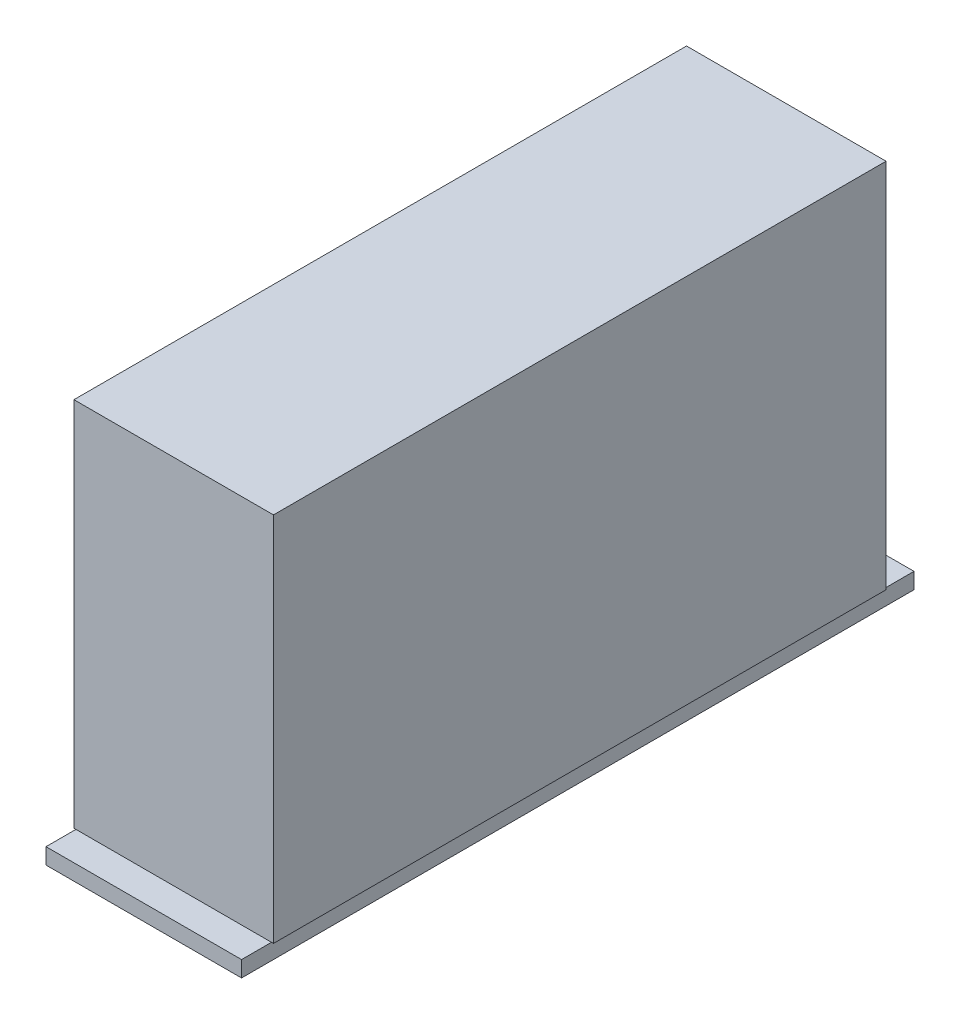
ISO-10303-21;
HEADER;
FILE_DESCRIPTION(('STEP AP214'),'2;1');
FILE_NAME('part.step','',(''),(''),'','','');
FILE_SCHEMA(('AUTOMOTIVE_DESIGN { 1 0 10303 214 1 1 1 1 }'));
ENDSEC;
DATA;
#1=APPLICATION_CONTEXT('core data for automotive mechanical design processes');
#2=APPLICATION_PROTOCOL_DEFINITION('international standard','automotive_design',2000,#1);
#3=PRODUCT_CONTEXT('',#1,'mechanical');
#4=PRODUCT('Part','Part','',(#3));
#5=PRODUCT_RELATED_PRODUCT_CATEGORY('part','',(#4));
#6=PRODUCT_DEFINITION_FORMATION('','',#4);
#7=PRODUCT_DEFINITION_CONTEXT('part definition',#1,'design');
#8=PRODUCT_DEFINITION('design','',#6,#7);
#9=PRODUCT_DEFINITION_SHAPE('','',#8);
#10=(LENGTH_UNIT() NAMED_UNIT(*) SI_UNIT(.MILLI.,.METRE.));
#11=(NAMED_UNIT(*) PLANE_ANGLE_UNIT() SI_UNIT($,.RADIAN.));
#12=(NAMED_UNIT(*) SI_UNIT($,.STERADIAN.) SOLID_ANGLE_UNIT());
#13=UNCERTAINTY_MEASURE_WITH_UNIT(LENGTH_MEASURE(1.E-05),#10,'distance_accuracy_value','');
#14=(GEOMETRIC_REPRESENTATION_CONTEXT(3) GLOBAL_UNCERTAINTY_ASSIGNED_CONTEXT((#13)) GLOBAL_UNIT_ASSIGNED_CONTEXT((#10,
#11,#12)) REPRESENTATION_CONTEXT('',''));
#15=CARTESIAN_POINT('',(0.,0.,0.));
#16=DIRECTION('',(0.,0.,1.));
#17=DIRECTION('',(1.,0.,0.));
#18=AXIS2_PLACEMENT_3D('',#15,#16,#17);
#19=CARTESIAN_POINT('',(-4.9,0.8,16.85));
#20=DIRECTION('',(0.,1.,0.));
#21=DIRECTION('',(0.,0.,1.));
#22=AXIS2_PLACEMENT_3D('',#19,#20,#21);
#23=PLANE('',#22);
#24=DIRECTION('',(1.,0.,0.));
#25=VECTOR('',#24,1.);
#26=CARTESIAN_POINT('',(5.,0.8,15.35));
#27=LINE('',#26,#25);
#28=CARTESIAN_POINT('',(-4.9,0.8,15.35));
#29=VERTEX_POINT('',#28);
#30=CARTESIAN_POINT('',(4.9,0.8,15.35));
#31=VERTEX_POINT('',#30);
#32=EDGE_CURVE('E11',#29,#31,#27,.T.);
#33=ORIENTED_EDGE('',*,*,#32,.F.);
#34=DIRECTION('',(0.,0.,1.));
#35=VECTOR('',#34,1.);
#36=CARTESIAN_POINT('',(-4.9,0.8,-16.85));
#37=LINE('',#36,#35);
#38=CARTESIAN_POINT('',(-4.9,0.8,16.85));
#39=VERTEX_POINT('',#38);
#40=EDGE_CURVE('E147',#29,#39,#37,.T.);
#41=ORIENTED_EDGE('',*,*,#40,.T.);
#42=DIRECTION('',(1.,0.,0.));
#43=VECTOR('',#42,1.);
#44=CARTESIAN_POINT('',(-4.9,0.8,16.85));
#45=LINE('',#44,#43);
#46=CARTESIAN_POINT('',(4.9,0.8,16.85));
#47=VERTEX_POINT('',#46);
#48=EDGE_CURVE('E150',#39,#47,#45,.T.);
#49=ORIENTED_EDGE('',*,*,#48,.T.);
#50=DIRECTION('',(0.,0.,-1.));
#51=VECTOR('',#50,1.);
#52=CARTESIAN_POINT('',(4.9,0.8,-16.85));
#53=LINE('',#52,#51);
#54=EDGE_CURVE('E154',#47,#31,#53,.T.);
#55=ORIENTED_EDGE('',*,*,#54,.T.);
#56=EDGE_LOOP('',(#33,#41,#49,#55));
#57=FACE_BOUND('',#56,.T.);
#58=ADVANCED_FACE('F16',(#57),#23,.T.);
#59=CARTESIAN_POINT('',(-4.9,0.8,-16.85));
#60=DIRECTION('',(1.,0.,0.));
#61=DIRECTION('',(0.,0.,-1.));
#62=AXIS2_PLACEMENT_3D('',#59,#60,#61);
#63=PLANE('',#62);
#64=DIRECTION('',(0.,0.,1.));
#65=VECTOR('',#64,1.);
#66=CARTESIAN_POINT('',(-4.9,0.,-16.85));
#67=LINE('',#66,#65);
#68=CARTESIAN_POINT('',(-4.9,0.,-16.85));
#69=VERTEX_POINT('',#68);
#70=CARTESIAN_POINT('',(-4.9,0.,16.85));
#71=VERTEX_POINT('',#70);
#72=EDGE_CURVE('E115',#69,#71,#67,.T.);
#73=ORIENTED_EDGE('',*,*,#72,.T.);
#74=DIRECTION('',(0.,-1.,0.));
#75=VECTOR('',#74,1.);
#76=CARTESIAN_POINT('',(-4.9,0.8,16.85));
#77=LINE('',#76,#75);
#78=EDGE_CURVE('E20',#39,#71,#77,.T.);
#79=ORIENTED_EDGE('',*,*,#78,.F.);
#80=ORIENTED_EDGE('',*,*,#40,.F.);
#81=CARTESIAN_POINT('',(-4.9,0.8,-15.35));
#82=VERTEX_POINT('',#81);
#83=EDGE_CURVE('E151',#82,#29,#37,.T.);
#84=ORIENTED_EDGE('',*,*,#83,.F.);
#85=CARTESIAN_POINT('',(-4.9,0.8,-16.85));
#86=VERTEX_POINT('',#85);
#87=EDGE_CURVE('E148',#86,#82,#37,.T.);
#88=ORIENTED_EDGE('',*,*,#87,.F.);
#89=DIRECTION('',(0.,-1.,0.));
#90=VECTOR('',#89,1.);
#91=CARTESIAN_POINT('',(-4.9,0.8,-16.85));
#92=LINE('',#91,#90);
#93=EDGE_CURVE('E158',#86,#69,#92,.T.);
#94=ORIENTED_EDGE('',*,*,#93,.T.);
#95=EDGE_LOOP('',(#73,#79,#80,#84,#88,#94));
#96=FACE_BOUND('',#95,.T.);
#97=ADVANCED_FACE('F18',(#96),#63,.F.);
#98=CARTESIAN_POINT('',(-4.9,0.8,16.85));
#99=DIRECTION('',(0.,0.,-1.));
#100=DIRECTION('',(-1.,0.,0.));
#101=AXIS2_PLACEMENT_3D('',#98,#99,#100);
#102=PLANE('',#101);
#103=DIRECTION('',(1.,0.,0.));
#104=VECTOR('',#103,1.);
#105=CARTESIAN_POINT('',(-4.9,0.,16.85));
#106=LINE('',#105,#104);
#107=CARTESIAN_POINT('',(4.9,0.,16.85));
#108=VERTEX_POINT('',#107);
#109=EDGE_CURVE('E141',#71,#108,#106,.T.);
#110=ORIENTED_EDGE('',*,*,#109,.T.);
#111=DIRECTION('',(0.,-1.,0.));
#112=VECTOR('',#111,1.);
#113=CARTESIAN_POINT('',(4.9,0.8,16.85));
#114=LINE('',#113,#112);
#115=EDGE_CURVE('E163',#47,#108,#114,.T.);
#116=ORIENTED_EDGE('',*,*,#115,.F.);
#117=ORIENTED_EDGE('',*,*,#48,.F.);
#118=ORIENTED_EDGE('',*,*,#78,.T.);
#119=EDGE_LOOP('',(#110,#116,#117,#118));
#120=FACE_BOUND('',#119,.T.);
#121=ADVANCED_FACE('F203',(#120),#102,.F.);
#122=CARTESIAN_POINT('',(4.9,0.8,-16.85));
#123=DIRECTION('',(-1.,0.,0.));
#124=DIRECTION('',(0.,0.,1.));
#125=AXIS2_PLACEMENT_3D('',#122,#123,#124);
#126=PLANE('',#125);
#127=DIRECTION('',(0.,0.,-1.));
#128=VECTOR('',#127,1.);
#129=CARTESIAN_POINT('',(4.9,0.,-16.85));
#130=LINE('',#129,#128);
#131=CARTESIAN_POINT('',(4.9,0.,-16.85));
#132=VERTEX_POINT('',#131);
#133=EDGE_CURVE('E143',#108,#132,#130,.T.);
#134=ORIENTED_EDGE('',*,*,#133,.T.);
#135=DIRECTION('',(0.,-1.,0.));
#136=VECTOR('',#135,1.);
#137=CARTESIAN_POINT('',(4.9,0.8,-16.85));
#138=LINE('',#137,#136);
#139=CARTESIAN_POINT('',(4.9,0.8,-16.85));
#140=VERTEX_POINT('',#139);
#141=EDGE_CURVE('E161',#140,#132,#138,.T.);
#142=ORIENTED_EDGE('',*,*,#141,.F.);
#143=CARTESIAN_POINT('',(4.9,0.8,-15.35));
#144=VERTEX_POINT('',#143);
#145=EDGE_CURVE('E153',#144,#140,#53,.T.);
#146=ORIENTED_EDGE('',*,*,#145,.F.);
#147=EDGE_CURVE('E41',#31,#144,#53,.T.);
#148=ORIENTED_EDGE('',*,*,#147,.F.);
#149=ORIENTED_EDGE('',*,*,#54,.F.);
#150=ORIENTED_EDGE('',*,*,#115,.T.);
#151=EDGE_LOOP('',(#134,#142,#146,#148,#149,#150));
#152=FACE_BOUND('',#151,.T.);
#153=ADVANCED_FACE('F215',(#152),#126,.F.);
#154=CARTESIAN_POINT('',(-4.9,0.8,-16.85));
#155=DIRECTION('',(0.,0.,1.));
#156=DIRECTION('',(1.,0.,0.));
#157=AXIS2_PLACEMENT_3D('',#154,#155,#156);
#158=PLANE('',#157);
#159=DIRECTION('',(-1.,0.,0.));
#160=VECTOR('',#159,1.);
#161=CARTESIAN_POINT('',(-4.9,0.,-16.85));
#162=LINE('',#161,#160);
#163=EDGE_CURVE('E145',#132,#69,#162,.T.);
#164=ORIENTED_EDGE('',*,*,#163,.T.);
#165=ORIENTED_EDGE('',*,*,#93,.F.);
#166=DIRECTION('',(-1.,0.,0.));
#167=VECTOR('',#166,1.);
#168=CARTESIAN_POINT('',(-4.9,0.8,-16.85));
#169=LINE('',#168,#167);
#170=EDGE_CURVE('E156',#140,#86,#169,.T.);
#171=ORIENTED_EDGE('',*,*,#170,.F.);
#172=ORIENTED_EDGE('',*,*,#141,.T.);
#173=EDGE_LOOP('',(#164,#165,#171,#172));
#174=FACE_BOUND('',#173,.T.);
#175=ADVANCED_FACE('F209',(#174),#158,.F.);
#176=DIRECTION('',(-1.,0.,0.));
#177=VECTOR('',#176,1.);
#178=CARTESIAN_POINT('',(5.,0.8,-15.35));
#179=LINE('',#178,#177);
#180=EDGE_CURVE('E25',#144,#82,#179,.T.);
#181=ORIENTED_EDGE('',*,*,#180,.F.);
#182=ORIENTED_EDGE('',*,*,#145,.T.);
#183=ORIENTED_EDGE('',*,*,#170,.T.);
#184=ORIENTED_EDGE('',*,*,#87,.T.);
#185=EDGE_LOOP('',(#181,#182,#183,#184));
#186=FACE_BOUND('',#185,.T.);
#187=ADVANCED_FACE('F199',(#186),#23,.T.);
#188=CARTESIAN_POINT('',(-4.9,0.,16.85));
#189=DIRECTION('',(0.,1.,0.));
#190=DIRECTION('',(0.,0.,1.));
#191=AXIS2_PLACEMENT_3D('',#188,#189,#190);
#192=PLANE('',#191);
#193=ORIENTED_EDGE('',*,*,#72,.F.);
#194=ORIENTED_EDGE('',*,*,#163,.F.);
#195=ORIENTED_EDGE('',*,*,#133,.F.);
#196=ORIENTED_EDGE('',*,*,#109,.F.);
#197=EDGE_LOOP('',(#193,#194,#195,#196));
#198=FACE_BOUND('',#197,.T.);
#199=ADVANCED_FACE('F208',(#198),#192,.F.);
#200=CARTESIAN_POINT('',(5.,0.8,15.35));
#201=DIRECTION('',(0.,-1.,0.));
#202=DIRECTION('',(0.,0.,-1.));
#203=AXIS2_PLACEMENT_3D('',#200,#201,#202);
#204=PLANE('',#203);
#205=CARTESIAN_POINT('',(-5.,0.8,-15.35));
#206=VERTEX_POINT('',#205);
#207=EDGE_CURVE('E105',#82,#206,#179,.T.);
#208=ORIENTED_EDGE('',*,*,#207,.F.);
#209=ORIENTED_EDGE('',*,*,#83,.T.);
#210=CARTESIAN_POINT('',(-5.,0.8,15.35));
#211=VERTEX_POINT('',#210);
#212=EDGE_CURVE('E27',#211,#29,#27,.T.);
#213=ORIENTED_EDGE('',*,*,#212,.F.);
#214=DIRECTION('',(0.,0.,1.));
#215=VECTOR('',#214,1.);
#216=CARTESIAN_POINT('',(-5.,0.8,-15.35));
#217=LINE('',#216,#215);
#218=EDGE_CURVE('E104',#206,#211,#217,.T.);
#219=ORIENTED_EDGE('',*,*,#218,.F.);
#220=EDGE_LOOP('',(#208,#209,#213,#219));
#221=FACE_BOUND('',#220,.T.);
#222=ADVANCED_FACE('F180',(#221),#204,.T.);
#223=CARTESIAN_POINT('',(5.,19.3999999999999,-15.35));
#224=DIRECTION('',(-1.,0.,0.));
#225=DIRECTION('',(0.,0.,1.));
#226=AXIS2_PLACEMENT_3D('',#223,#224,#225);
#227=PLANE('',#226);
#228=DIRECTION('',(0.,0.,-1.));
#229=VECTOR('',#228,1.);
#230=CARTESIAN_POINT('',(5.,0.8,-15.35));
#231=LINE('',#230,#229);
#232=CARTESIAN_POINT('',(5.,0.8,15.35));
#233=VERTEX_POINT('',#232);
#234=CARTESIAN_POINT('',(5.,0.8,-15.35));
#235=VERTEX_POINT('',#234);
#236=EDGE_CURVE('E102',#233,#235,#231,.T.);
#237=ORIENTED_EDGE('',*,*,#236,.T.);
#238=DIRECTION('',(0.,-1.,0.));
#239=VECTOR('',#238,1.);
#240=CARTESIAN_POINT('',(5.,19.3999999999999,-15.35));
#241=LINE('',#240,#239);
#242=CARTESIAN_POINT('',(5.,19.3999999999999,-15.35));
#243=VERTEX_POINT('',#242);
#244=EDGE_CURVE('E108',#243,#235,#241,.T.);
#245=ORIENTED_EDGE('',*,*,#244,.F.);
#246=DIRECTION('',(0.,0.,-1.));
#247=VECTOR('',#246,1.);
#248=CARTESIAN_POINT('',(5.,19.3999999999999,-15.35));
#249=LINE('',#248,#247);
#250=CARTESIAN_POINT('',(5.,19.3999999999999,15.35));
#251=VERTEX_POINT('',#250);
#252=EDGE_CURVE('E126',#251,#243,#249,.T.);
#253=ORIENTED_EDGE('',*,*,#252,.F.);
#254=DIRECTION('',(0.,-1.,0.));
#255=VECTOR('',#254,1.);
#256=CARTESIAN_POINT('',(5.,19.3999999999999,15.35));
#257=LINE('',#256,#255);
#258=EDGE_CURVE('E121',#251,#233,#257,.T.);
#259=ORIENTED_EDGE('',*,*,#258,.T.);
#260=EDGE_LOOP('',(#237,#245,#253,#259));
#261=FACE_BOUND('',#260,.T.);
#262=ADVANCED_FACE('F119',(#261),#227,.F.);
#263=CARTESIAN_POINT('',(5.,19.3999999999999,-15.35));
#264=DIRECTION('',(0.,0.,1.));
#265=DIRECTION('',(1.,0.,0.));
#266=AXIS2_PLACEMENT_3D('',#263,#264,#265);
#267=PLANE('',#266);
#268=EDGE_CURVE('E97',#235,#144,#179,.T.);
#269=ORIENTED_EDGE('',*,*,#268,.T.);
#270=ORIENTED_EDGE('',*,*,#180,.T.);
#271=ORIENTED_EDGE('',*,*,#207,.T.);
#272=DIRECTION('',(0.,-1.,0.));
#273=VECTOR('',#272,1.);
#274=CARTESIAN_POINT('',(-5.,19.3999999999999,-15.35));
#275=LINE('',#274,#273);
#276=CARTESIAN_POINT('',(-5.,19.3999999999999,-15.35));
#277=VERTEX_POINT('',#276);
#278=EDGE_CURVE('E116',#277,#206,#275,.T.);
#279=ORIENTED_EDGE('',*,*,#278,.F.);
#280=DIRECTION('',(-1.,0.,0.));
#281=VECTOR('',#280,1.);
#282=CARTESIAN_POINT('',(5.,19.3999999999999,-15.35));
#283=LINE('',#282,#281);
#284=EDGE_CURVE('E111',#243,#277,#283,.T.);
#285=ORIENTED_EDGE('',*,*,#284,.F.);
#286=ORIENTED_EDGE('',*,*,#244,.T.);
#287=EDGE_LOOP('',(#269,#270,#271,#279,#285,#286));
#288=FACE_BOUND('',#287,.T.);
#289=ADVANCED_FACE('F109',(#288),#267,.F.);
#290=CARTESIAN_POINT('',(-5.,19.3999999999999,-15.35));
#291=DIRECTION('',(1.,0.,0.));
#292=DIRECTION('',(0.,0.,-1.));
#293=AXIS2_PLACEMENT_3D('',#290,#291,#292);
#294=PLANE('',#293);
#295=ORIENTED_EDGE('',*,*,#218,.T.);
#296=DIRECTION('',(0.,-1.,0.));
#297=VECTOR('',#296,1.);
#298=CARTESIAN_POINT('',(-5.,19.3999999999999,15.35));
#299=LINE('',#298,#297);
#300=CARTESIAN_POINT('',(-5.,19.3999999999999,15.35));
#301=VERTEX_POINT('',#300);
#302=EDGE_CURVE('E134',#301,#211,#299,.T.);
#303=ORIENTED_EDGE('',*,*,#302,.F.);
#304=DIRECTION('',(0.,0.,1.));
#305=VECTOR('',#304,1.);
#306=CARTESIAN_POINT('',(-5.,19.3999999999999,-15.35));
#307=LINE('',#306,#305);
#308=EDGE_CURVE('E129',#277,#301,#307,.T.);
#309=ORIENTED_EDGE('',*,*,#308,.F.);
#310=ORIENTED_EDGE('',*,*,#278,.T.);
#311=EDGE_LOOP('',(#295,#303,#309,#310));
#312=FACE_BOUND('',#311,.T.);
#313=ADVANCED_FACE('F177',(#312),#294,.F.);
#314=CARTESIAN_POINT('',(5.,19.3999999999999,15.35));
#315=DIRECTION('',(0.,0.,-1.));
#316=DIRECTION('',(-1.,0.,0.));
#317=AXIS2_PLACEMENT_3D('',#314,#315,#316);
#318=PLANE('',#317);
#319=ORIENTED_EDGE('',*,*,#212,.T.);
#320=ORIENTED_EDGE('',*,*,#32,.T.);
#321=EDGE_CURVE('E28',#31,#233,#27,.T.);
#322=ORIENTED_EDGE('',*,*,#321,.T.);
#323=ORIENTED_EDGE('',*,*,#258,.F.);
#324=DIRECTION('',(1.,0.,0.));
#325=VECTOR('',#324,1.);
#326=CARTESIAN_POINT('',(5.,19.3999999999999,15.35));
#327=LINE('',#326,#325);
#328=EDGE_CURVE('E131',#301,#251,#327,.T.);
#329=ORIENTED_EDGE('',*,*,#328,.F.);
#330=ORIENTED_EDGE('',*,*,#302,.T.);
#331=EDGE_LOOP('',(#319,#320,#322,#323,#329,#330));
#332=FACE_BOUND('',#331,.T.);
#333=ADVANCED_FACE('F183',(#332),#318,.F.);
#334=CARTESIAN_POINT('',(5.,19.3999999999999,15.35));
#335=DIRECTION('',(0.,-1.,0.));
#336=DIRECTION('',(0.,0.,-1.));
#337=AXIS2_PLACEMENT_3D('',#334,#335,#336);
#338=PLANE('',#337);
#339=ORIENTED_EDGE('',*,*,#252,.T.);
#340=ORIENTED_EDGE('',*,*,#284,.T.);
#341=ORIENTED_EDGE('',*,*,#308,.T.);
#342=ORIENTED_EDGE('',*,*,#328,.T.);
#343=EDGE_LOOP('',(#339,#340,#341,#342));
#344=FACE_BOUND('',#343,.T.);
#345=ADVANCED_FACE('F186',(#344),#338,.F.);
#346=ORIENTED_EDGE('',*,*,#321,.F.);
#347=ORIENTED_EDGE('',*,*,#147,.T.);
#348=ORIENTED_EDGE('',*,*,#268,.F.);
#349=ORIENTED_EDGE('',*,*,#236,.F.);
#350=EDGE_LOOP('',(#346,#347,#348,#349));
#351=FACE_BOUND('',#350,.T.);
#352=ADVANCED_FACE('F100',(#351),#204,.T.);
#353=CLOSED_SHELL('',(#58,#97,#121,#153,#175,#187,#199,#222,#262,#289,#313,#333,#345,#352));
#354=MANIFOLD_SOLID_BREP('B1',#353);
#355=ADVANCED_BREP_SHAPE_REPRESENTATION('',(#18,#354),#14);
#356=SHAPE_DEFINITION_REPRESENTATION(#9,#355);
ENDSEC;
END-ISO-10303-21;
